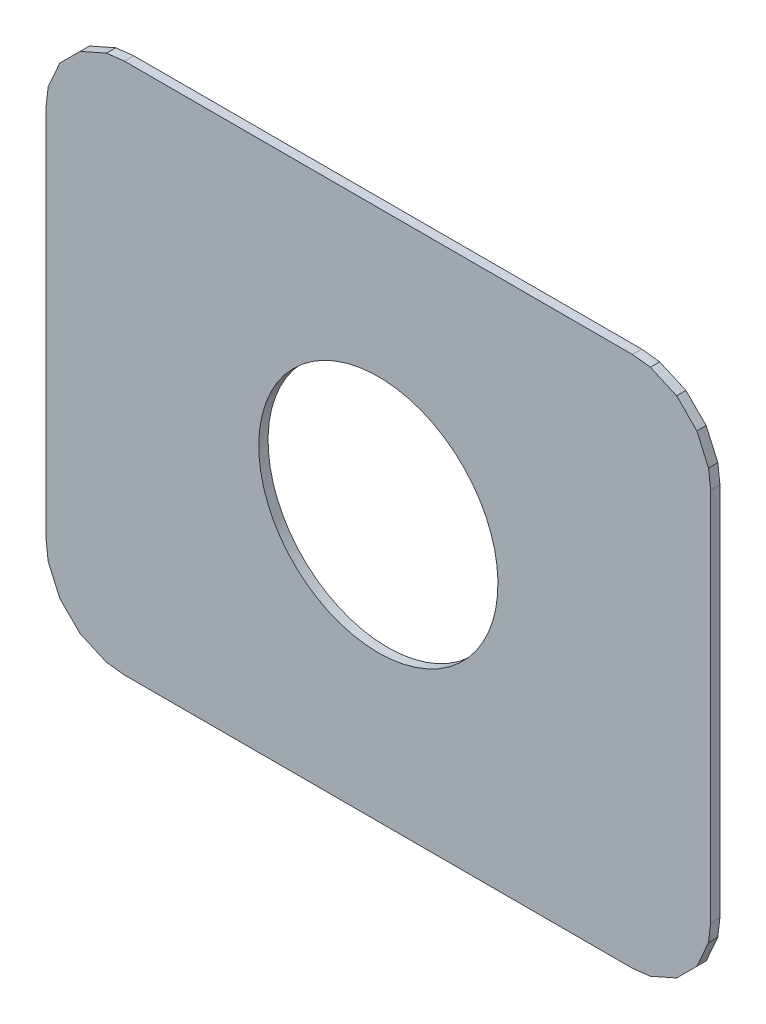
ISO-10303-21;
HEADER;
FILE_DESCRIPTION(('STEP AP214'),'2;1');
FILE_NAME('part.step','',(''),(''),'','','');
FILE_SCHEMA(('AUTOMOTIVE_DESIGN { 1 0 10303 214 1 1 1 1 }'));
ENDSEC;
DATA;
#1=APPLICATION_CONTEXT('core data for automotive mechanical design processes');
#2=APPLICATION_PROTOCOL_DEFINITION('international standard','automotive_design',2000,#1);
#3=PRODUCT_CONTEXT('',#1,'mechanical');
#4=PRODUCT('Part','Part','',(#3));
#5=PRODUCT_RELATED_PRODUCT_CATEGORY('part','',(#4));
#6=PRODUCT_DEFINITION_FORMATION('','',#4);
#7=PRODUCT_DEFINITION_CONTEXT('part definition',#1,'design');
#8=PRODUCT_DEFINITION('design','',#6,#7);
#9=PRODUCT_DEFINITION_SHAPE('','',#8);
#10=(LENGTH_UNIT() NAMED_UNIT(*) SI_UNIT(.MILLI.,.METRE.));
#11=(NAMED_UNIT(*) PLANE_ANGLE_UNIT() SI_UNIT($,.RADIAN.));
#12=(NAMED_UNIT(*) SI_UNIT($,.STERADIAN.) SOLID_ANGLE_UNIT());
#13=UNCERTAINTY_MEASURE_WITH_UNIT(LENGTH_MEASURE(1.E-05),#10,'distance_accuracy_value','');
#14=(GEOMETRIC_REPRESENTATION_CONTEXT(3) GLOBAL_UNCERTAINTY_ASSIGNED_CONTEXT((#13)) GLOBAL_UNIT_ASSIGNED_CONTEXT((#10,
#11,#12)) REPRESENTATION_CONTEXT('',''));
#15=CARTESIAN_POINT('',(0.,0.,0.));
#16=DIRECTION('',(0.,0.,1.));
#17=DIRECTION('',(1.,0.,0.));
#18=AXIS2_PLACEMENT_3D('',#15,#16,#17);
#19=CARTESIAN_POINT('',(177.26,-119.456,-0.045));
#20=DIRECTION('',(0.,0.,-1.));
#21=DIRECTION('',(0.,-1.,0.));
#22=AXIS2_PLACEMENT_3D('',#19,#20,#21);
#23=CYLINDRICAL_SURFACE('',#22,0.45);
#24=CARTESIAN_POINT('',(177.26,-119.456,-0.035));
#25=DIRECTION('',(0.,0.,-1.));
#26=DIRECTION('',(0.,-1.,0.));
#27=AXIS2_PLACEMENT_3D('',#24,#25,#26);
#28=CIRCLE('',#27,0.45);
#29=CARTESIAN_POINT('',(177.26,-119.906,-0.035));
#30=VERTEX_POINT('',#29);
#31=EDGE_CURVE('E283',#30,#30,#28,.T.);
#32=ORIENTED_EDGE('',*,*,#31,.T.);
#33=DIRECTION('',(0.,0.,1.));
#34=VECTOR('',#33,1.);
#35=CARTESIAN_POINT('',(177.26,-119.906,-0.045));
#36=LINE('',#35,#34);
#37=CARTESIAN_POINT('',(177.26,-119.906,0.));
#38=VERTEX_POINT('',#37);
#39=EDGE_CURVE('E11',#30,#38,#36,.T.);
#40=ORIENTED_EDGE('',*,*,#39,.T.);
#41=CARTESIAN_POINT('',(177.26,-119.456,0.));
#42=DIRECTION('',(0.,0.,-1.));
#43=DIRECTION('',(0.,-1.,0.));
#44=AXIS2_PLACEMENT_3D('',#41,#42,#43);
#45=CIRCLE('',#44,0.45);
#46=EDGE_CURVE('E418',#38,#38,#45,.T.);
#47=ORIENTED_EDGE('',*,*,#46,.F.);
#48=ORIENTED_EDGE('',*,*,#39,.F.);
#49=EDGE_LOOP('',(#32,#40,#47,#48));
#50=FACE_BOUND('',#49,.T.);
#51=ADVANCED_FACE('F17',(#50),#23,.F.);
#52=CARTESIAN_POINT('',(176.23678,-120.448188,-0.035));
#53=DIRECTION('',(-0.403918300516903,-0.91479506257278,0.));
#54=DIRECTION('',(-0.91479506257278,0.403918300516903,0.));
#55=AXIS2_PLACEMENT_3D('',#52,#53,#54);
#56=PLANE('',#55);
#57=DIRECTION('',(0.,0.,1.));
#58=VECTOR('',#57,1.);
#59=CARTESIAN_POINT('',(176.23678,-120.448188,-0.035));
#60=LINE('',#59,#58);
#61=CARTESIAN_POINT('',(176.23678,-120.448188,-0.035));
#62=VERTEX_POINT('',#61);
#63=CARTESIAN_POINT('',(176.23678,-120.448188,0.));
#64=VERTEX_POINT('',#63);
#65=EDGE_CURVE('E25',#62,#64,#60,.T.);
#66=ORIENTED_EDGE('',*,*,#65,.T.);
#67=DIRECTION('',(-0.91479506257278,0.403918300516903,0.));
#68=VECTOR('',#67,1.);
#69=CARTESIAN_POINT('',(176.23678,-120.448188,0.));
#70=LINE('',#69,#68);
#71=CARTESIAN_POINT('',(176.137901,-120.404529,0.));
#72=VERTEX_POINT('',#71);
#73=EDGE_CURVE('E366',#64,#72,#70,.T.);
#74=ORIENTED_EDGE('',*,*,#73,.T.);
#75=DIRECTION('',(0.,0.,1.));
#76=VECTOR('',#75,1.);
#77=CARTESIAN_POINT('',(176.137901,-120.404529,-0.035));
#78=LINE('',#77,#76);
#79=CARTESIAN_POINT('',(176.137901,-120.404529,-0.035));
#80=VERTEX_POINT('',#79);
#81=EDGE_CURVE('E348',#80,#72,#78,.T.);
#82=ORIENTED_EDGE('',*,*,#81,.F.);
#83=DIRECTION('',(-0.91479506257278,0.403918300516903,0.));
#84=VECTOR('',#83,1.);
#85=CARTESIAN_POINT('',(176.23678,-120.448188,-0.035));
#86=LINE('',#85,#84);
#87=EDGE_CURVE('E295',#62,#80,#86,.T.);
#88=ORIENTED_EDGE('',*,*,#87,.F.);
#89=EDGE_LOOP('',(#66,#74,#82,#88));
#90=FACE_BOUND('',#89,.T.);
#91=ADVANCED_FACE('F456',(#90),#56,.T.);
#92=CARTESIAN_POINT('',(176.304118,-120.456,-0.035));
#93=DIRECTION('',(-0.115238869062998,-0.99333780913498,0.));
#94=DIRECTION('',(-0.99333780913498,0.115238869062998,0.));
#95=AXIS2_PLACEMENT_3D('',#92,#93,#94);
#96=PLANE('',#95);
#97=DIRECTION('',(0.,0.,1.));
#98=VECTOR('',#97,1.);
#99=CARTESIAN_POINT('',(176.304118,-120.456,-0.035));
#100=LINE('',#99,#98);
#101=CARTESIAN_POINT('',(176.304118,-120.456,-0.035));
#102=VERTEX_POINT('',#101);
#103=CARTESIAN_POINT('',(176.304118,-120.456,0.));
#104=VERTEX_POINT('',#103);
#105=EDGE_CURVE('E345',#102,#104,#100,.T.);
#106=ORIENTED_EDGE('',*,*,#105,.T.);
#107=DIRECTION('',(-0.99333780913498,0.115238869062998,0.));
#108=VECTOR('',#107,1.);
#109=CARTESIAN_POINT('',(176.304118,-120.456,0.));
#110=LINE('',#109,#108);
#111=EDGE_CURVE('E370',#104,#64,#110,.T.);
#112=ORIENTED_EDGE('',*,*,#111,.T.);
#113=ORIENTED_EDGE('',*,*,#65,.F.);
#114=DIRECTION('',(-0.99333780913498,0.115238869062998,0.));
#115=VECTOR('',#114,1.);
#116=CARTESIAN_POINT('',(176.304118,-120.456,-0.035));
#117=LINE('',#116,#115);
#118=EDGE_CURVE('E291',#102,#62,#117,.T.);
#119=ORIENTED_EDGE('',*,*,#118,.F.);
#120=EDGE_LOOP('',(#106,#112,#113,#119));
#121=FACE_BOUND('',#120,.T.);
#122=ADVANCED_FACE('F462',(#121),#96,.T.);
#123=CARTESIAN_POINT('',(176.137901,-120.404529,-0.035));
#124=DIRECTION('',(-0.707106781187048,-0.707106781186048,0.));
#125=DIRECTION('',(-0.707106781186048,0.707106781187048,0.));
#126=AXIS2_PLACEMENT_3D('',#123,#124,#125);
#127=PLANE('',#126);
#128=ORIENTED_EDGE('',*,*,#81,.T.);
#129=DIRECTION('',(-0.707106781186048,0.707106781187048,0.));
#130=VECTOR('',#129,1.);
#131=CARTESIAN_POINT('',(176.137901,-120.404529,0.));
#132=LINE('',#131,#130);
#133=CARTESIAN_POINT('',(176.061471,-120.328099,0.));
#134=VERTEX_POINT('',#133);
#135=EDGE_CURVE('E371',#72,#134,#132,.T.);
#136=ORIENTED_EDGE('',*,*,#135,.T.);
#137=DIRECTION('',(0.,0.,1.));
#138=VECTOR('',#137,1.);
#139=CARTESIAN_POINT('',(176.061471,-120.328099,-0.035));
#140=LINE('',#139,#138);
#141=CARTESIAN_POINT('',(176.061471,-120.328099,-0.035));
#142=VERTEX_POINT('',#141);
#143=EDGE_CURVE('E349',#142,#134,#140,.T.);
#144=ORIENTED_EDGE('',*,*,#143,.F.);
#145=DIRECTION('',(-0.707106781186048,0.707106781187048,0.));
#146=VECTOR('',#145,1.);
#147=CARTESIAN_POINT('',(176.137901,-120.404529,-0.035));
#148=LINE('',#147,#146);
#149=EDGE_CURVE('E299',#80,#142,#148,.T.);
#150=ORIENTED_EDGE('',*,*,#149,.F.);
#151=EDGE_LOOP('',(#128,#136,#144,#150));
#152=FACE_BOUND('',#151,.T.);
#153=ADVANCED_FACE('F471',(#152),#127,.T.);
#154=CARTESIAN_POINT('',(178.215882,-120.456,-0.035));
#155=DIRECTION('',(0.,-1.,0.));
#156=DIRECTION('',(0.,0.,-1.));
#157=AXIS2_PLACEMENT_3D('',#154,#155,#156);
#158=PLANE('',#157);
#159=DIRECTION('',(0.,0.,1.));
#160=VECTOR('',#159,1.);
#161=CARTESIAN_POINT('',(178.215882,-120.456,-0.035));
#162=LINE('',#161,#160);
#163=CARTESIAN_POINT('',(178.215882,-120.456,-0.035));
#164=VERTEX_POINT('',#163);
#165=CARTESIAN_POINT('',(178.215882,-120.456,0.));
#166=VERTEX_POINT('',#165);
#167=EDGE_CURVE('E258',#164,#166,#162,.T.);
#168=ORIENTED_EDGE('',*,*,#167,.T.);
#169=DIRECTION('',(-1.,0.,0.));
#170=VECTOR('',#169,1.);
#171=CARTESIAN_POINT('',(178.215882,-120.456,0.));
#172=LINE('',#171,#170);
#173=EDGE_CURVE('E380',#166,#104,#172,.T.);
#174=ORIENTED_EDGE('',*,*,#173,.T.);
#175=ORIENTED_EDGE('',*,*,#105,.F.);
#176=DIRECTION('',(-1.,0.,0.));
#177=VECTOR('',#176,1.);
#178=CARTESIAN_POINT('',(178.215882,-120.456,-0.035));
#179=LINE('',#178,#177);
#180=EDGE_CURVE('E263',#164,#102,#179,.T.);
#181=ORIENTED_EDGE('',*,*,#180,.F.);
#182=EDGE_LOOP('',(#168,#174,#175,#181));
#183=FACE_BOUND('',#182,.T.);
#184=ADVANCED_FACE('F475',(#183),#158,.T.);
#185=CARTESIAN_POINT('',(176.061471,-120.328099,-0.035));
#186=DIRECTION('',(-0.914795062572411,-0.40391830051774,0.));
#187=DIRECTION('',(-0.40391830051774,0.914795062572411,0.));
#188=AXIS2_PLACEMENT_3D('',#185,#186,#187);
#189=PLANE('',#188);
#190=ORIENTED_EDGE('',*,*,#143,.T.);
#191=DIRECTION('',(-0.40391830051774,0.914795062572411,0.));
#192=VECTOR('',#191,1.);
#193=CARTESIAN_POINT('',(176.061471,-120.328099,0.));
#194=LINE('',#193,#192);
#195=CARTESIAN_POINT('',(176.017812,-120.22922,0.));
#196=VERTEX_POINT('',#195);
#197=EDGE_CURVE('E376',#134,#196,#194,.T.);
#198=ORIENTED_EDGE('',*,*,#197,.T.);
#199=DIRECTION('',(0.,0.,1.));
#200=VECTOR('',#199,1.);
#201=CARTESIAN_POINT('',(176.017812,-120.22922,-0.035));
#202=LINE('',#201,#200);
#203=CARTESIAN_POINT('',(176.017812,-120.22922,-0.035));
#204=VERTEX_POINT('',#203);
#205=EDGE_CURVE('E252',#204,#196,#202,.T.);
#206=ORIENTED_EDGE('',*,*,#205,.F.);
#207=DIRECTION('',(-0.40391830051774,0.914795062572411,0.));
#208=VECTOR('',#207,1.);
#209=CARTESIAN_POINT('',(176.061471,-120.328099,-0.035));
#210=LINE('',#209,#208);
#211=EDGE_CURVE('E303',#142,#204,#210,.T.);
#212=ORIENTED_EDGE('',*,*,#211,.F.);
#213=EDGE_LOOP('',(#190,#198,#206,#212));
#214=FACE_BOUND('',#213,.T.);
#215=ADVANCED_FACE('F619',(#214),#189,.T.);
#216=CARTESIAN_POINT('',(178.28322,-120.448188,-0.035));
#217=DIRECTION('',(0.115238869062998,-0.99333780913498,0.));
#218=DIRECTION('',(0.,0.,-1.));
#219=AXIS2_PLACEMENT_3D('',#216,#217,#218);
#220=PLANE('',#219);
#221=DIRECTION('',(0.,0.,1.));
#222=VECTOR('',#221,1.);
#223=CARTESIAN_POINT('',(178.28322,-120.448188,-0.035));
#224=LINE('',#223,#222);
#225=CARTESIAN_POINT('',(178.28322,-120.448188,-0.035));
#226=VERTEX_POINT('',#225);
#227=CARTESIAN_POINT('',(178.28322,-120.448188,0.));
#228=VERTEX_POINT('',#227);
#229=EDGE_CURVE('E240',#226,#228,#224,.T.);
#230=ORIENTED_EDGE('',*,*,#229,.T.);
#231=DIRECTION('',(-0.99333780913498,-0.115238869062998,0.));
#232=VECTOR('',#231,1.);
#233=CARTESIAN_POINT('',(178.28322,-120.448188,0.));
#234=LINE('',#233,#232);
#235=EDGE_CURVE('E384',#228,#166,#234,.T.);
#236=ORIENTED_EDGE('',*,*,#235,.T.);
#237=ORIENTED_EDGE('',*,*,#167,.F.);
#238=DIRECTION('',(-0.99333780913498,-0.115238869062998,0.));
#239=VECTOR('',#238,1.);
#240=CARTESIAN_POINT('',(178.28322,-120.448188,-0.035));
#241=LINE('',#240,#239);
#242=EDGE_CURVE('E256',#226,#164,#241,.T.);
#243=ORIENTED_EDGE('',*,*,#242,.F.);
#244=EDGE_LOOP('',(#230,#236,#237,#243));
#245=FACE_BOUND('',#244,.T.);
#246=ADVANCED_FACE('F257',(#245),#220,.T.);
#247=CARTESIAN_POINT('',(176.017812,-120.22922,-0.035));
#248=DIRECTION('',(-0.99333780913498,-0.115238869062998,0.));
#249=DIRECTION('',(-0.115238869062998,0.99333780913498,0.));
#250=AXIS2_PLACEMENT_3D('',#247,#248,#249);
#251=PLANE('',#250);
#252=ORIENTED_EDGE('',*,*,#205,.T.);
#253=DIRECTION('',(-0.115238869062998,0.99333780913498,0.));
#254=VECTOR('',#253,1.);
#255=CARTESIAN_POINT('',(176.017812,-120.22922,0.));
#256=LINE('',#255,#254);
#257=CARTESIAN_POINT('',(176.01,-120.161882,0.));
#258=VERTEX_POINT('',#257);
#259=EDGE_CURVE('E372',#196,#258,#256,.T.);
#260=ORIENTED_EDGE('',*,*,#259,.T.);
#261=DIRECTION('',(0.,0.,1.));
#262=VECTOR('',#261,1.);
#263=CARTESIAN_POINT('',(176.01,-120.161882,-0.035));
#264=LINE('',#263,#262);
#265=CARTESIAN_POINT('',(176.01,-120.161882,-0.035));
#266=VERTEX_POINT('',#265);
#267=EDGE_CURVE('E253',#266,#258,#264,.T.);
#268=ORIENTED_EDGE('',*,*,#267,.F.);
#269=DIRECTION('',(-0.115238869062998,0.99333780913498,0.));
#270=VECTOR('',#269,1.);
#271=CARTESIAN_POINT('',(176.017812,-120.22922,-0.035));
#272=LINE('',#271,#270);
#273=EDGE_CURVE('E307',#204,#266,#272,.T.);
#274=ORIENTED_EDGE('',*,*,#273,.F.);
#275=EDGE_LOOP('',(#252,#260,#268,#274));
#276=FACE_BOUND('',#275,.T.);
#277=ADVANCED_FACE('F625',(#276),#251,.T.);
#278=CARTESIAN_POINT('',(178.382099,-120.404529,-0.035));
#279=DIRECTION('',(0.403918300516903,-0.91479506257278,0.));
#280=DIRECTION('',(0.,0.,-1.));
#281=AXIS2_PLACEMENT_3D('',#278,#279,#280);
#282=PLANE('',#281);
#283=DIRECTION('',(0.,0.,1.));
#284=VECTOR('',#283,1.);
#285=CARTESIAN_POINT('',(178.382099,-120.404529,-0.035));
#286=LINE('',#285,#284);
#287=CARTESIAN_POINT('',(178.382099,-120.404529,-0.035));
#288=VERTEX_POINT('',#287);
#289=CARTESIAN_POINT('',(178.382099,-120.404529,0.));
#290=VERTEX_POINT('',#289);
#291=EDGE_CURVE('E393',#288,#290,#286,.T.);
#292=ORIENTED_EDGE('',*,*,#291,.T.);
#293=DIRECTION('',(-0.91479506257278,-0.403918300516903,0.));
#294=VECTOR('',#293,1.);
#295=CARTESIAN_POINT('',(178.382099,-120.404529,0.));
#296=LINE('',#295,#294);
#297=EDGE_CURVE('E247',#290,#228,#296,.T.);
#298=ORIENTED_EDGE('',*,*,#297,.T.);
#299=ORIENTED_EDGE('',*,*,#229,.F.);
#300=DIRECTION('',(-0.91479506257278,-0.403918300516903,0.));
#301=VECTOR('',#300,1.);
#302=CARTESIAN_POINT('',(178.382099,-120.404529,-0.035));
#303=LINE('',#302,#301);
#304=EDGE_CURVE('E244',#288,#226,#303,.T.);
#305=ORIENTED_EDGE('',*,*,#304,.F.);
#306=EDGE_LOOP('',(#292,#298,#299,#305));
#307=FACE_BOUND('',#306,.T.);
#308=ADVANCED_FACE('F242',(#307),#282,.T.);
#309=CARTESIAN_POINT('',(176.01,-120.161882,-0.035));
#310=DIRECTION('',(-1.,0.,0.));
#311=DIRECTION('',(0.,0.,1.));
#312=AXIS2_PLACEMENT_3D('',#309,#310,#311);
#313=PLANE('',#312);
#314=ORIENTED_EDGE('',*,*,#267,.T.);
#315=DIRECTION('',(0.,1.,0.));
#316=VECTOR('',#315,1.);
#317=CARTESIAN_POINT('',(176.01,-120.161882,0.));
#318=LINE('',#317,#316);
#319=CARTESIAN_POINT('',(176.01,-118.750118,0.));
#320=VERTEX_POINT('',#319);
#321=EDGE_CURVE('E365',#258,#320,#318,.T.);
#322=ORIENTED_EDGE('',*,*,#321,.T.);
#323=DIRECTION('',(0.,0.,1.));
#324=VECTOR('',#323,1.);
#325=CARTESIAN_POINT('',(176.01,-118.750118,-0.035));
#326=LINE('',#325,#324);
#327=CARTESIAN_POINT('',(176.01,-118.750118,-0.035));
#328=VERTEX_POINT('',#327);
#329=EDGE_CURVE('E396',#328,#320,#326,.T.);
#330=ORIENTED_EDGE('',*,*,#329,.F.);
#331=DIRECTION('',(0.,1.,0.));
#332=VECTOR('',#331,1.);
#333=CARTESIAN_POINT('',(176.01,-120.161882,-0.035));
#334=LINE('',#333,#332);
#335=EDGE_CURVE('E308',#266,#328,#334,.T.);
#336=ORIENTED_EDGE('',*,*,#335,.F.);
#337=EDGE_LOOP('',(#314,#322,#330,#336));
#338=FACE_BOUND('',#337,.T.);
#339=ADVANCED_FACE('F858',(#338),#313,.T.);
#340=CARTESIAN_POINT('',(178.458529,-120.328099,-0.035));
#341=DIRECTION('',(0.707106781187048,-0.707106781186048,0.));
#342=DIRECTION('',(0.,0.,-1.));
#343=AXIS2_PLACEMENT_3D('',#340,#341,#342);
#344=PLANE('',#343);
#345=DIRECTION('',(0.,0.,1.));
#346=VECTOR('',#345,1.);
#347=CARTESIAN_POINT('',(178.458529,-120.328099,-0.035));
#348=LINE('',#347,#346);
#349=CARTESIAN_POINT('',(178.458529,-120.328099,-0.035));
#350=VERTEX_POINT('',#349);
#351=CARTESIAN_POINT('',(178.458529,-120.328099,0.));
#352=VERTEX_POINT('',#351);
#353=EDGE_CURVE('E437',#350,#352,#348,.T.);
#354=ORIENTED_EDGE('',*,*,#353,.T.);
#355=DIRECTION('',(-0.707106781186048,-0.707106781187048,0.));
#356=VECTOR('',#355,1.);
#357=CARTESIAN_POINT('',(178.458529,-120.328099,0.));
#358=LINE('',#357,#356);
#359=EDGE_CURVE('E392',#352,#290,#358,.T.);
#360=ORIENTED_EDGE('',*,*,#359,.T.);
#361=ORIENTED_EDGE('',*,*,#291,.F.);
#362=DIRECTION('',(-0.707106781186048,-0.707106781187048,0.));
#363=VECTOR('',#362,1.);
#364=CARTESIAN_POINT('',(178.458529,-120.328099,-0.035));
#365=LINE('',#364,#363);
#366=EDGE_CURVE('E269',#350,#288,#365,.T.);
#367=ORIENTED_EDGE('',*,*,#366,.F.);
#368=EDGE_LOOP('',(#354,#360,#361,#367));
#369=FACE_BOUND('',#368,.T.);
#370=ADVANCED_FACE('F480',(#369),#344,.T.);
#371=CARTESIAN_POINT('',(176.01,-118.750118,-0.035));
#372=DIRECTION('',(-0.99333780913498,0.115238869062998,0.));
#373=DIRECTION('',(0.,0.,1.));
#374=AXIS2_PLACEMENT_3D('',#371,#372,#373);
#375=PLANE('',#374);
#376=ORIENTED_EDGE('',*,*,#329,.T.);
#377=DIRECTION('',(0.115238869062998,0.99333780913498,0.));
#378=VECTOR('',#377,1.);
#379=CARTESIAN_POINT('',(176.01,-118.750118,0.));
#380=LINE('',#379,#378);
#381=CARTESIAN_POINT('',(176.017812,-118.68278,0.));
#382=VERTEX_POINT('',#381);
#383=EDGE_CURVE('E361',#320,#382,#380,.T.);
#384=ORIENTED_EDGE('',*,*,#383,.T.);
#385=DIRECTION('',(0.,0.,1.));
#386=VECTOR('',#385,1.);
#387=CARTESIAN_POINT('',(176.017812,-118.68278,-0.035));
#388=LINE('',#387,#386);
#389=CARTESIAN_POINT('',(176.017812,-118.68278,-0.035));
#390=VERTEX_POINT('',#389);
#391=EDGE_CURVE('E436',#390,#382,#388,.T.);
#392=ORIENTED_EDGE('',*,*,#391,.F.);
#393=DIRECTION('',(0.115238869062998,0.99333780913498,0.));
#394=VECTOR('',#393,1.);
#395=CARTESIAN_POINT('',(176.01,-118.750118,-0.035));
#396=LINE('',#395,#394);
#397=EDGE_CURVE('E312',#328,#390,#396,.T.);
#398=ORIENTED_EDGE('',*,*,#397,.F.);
#399=EDGE_LOOP('',(#376,#384,#392,#398));
#400=FACE_BOUND('',#399,.T.);
#401=ADVANCED_FACE('F852',(#400),#375,.T.);
#402=CARTESIAN_POINT('',(178.502188,-120.22922,-0.035));
#403=DIRECTION('',(0.91479506257278,-0.403918300516903,0.));
#404=DIRECTION('',(0.,0.,-1.));
#405=AXIS2_PLACEMENT_3D('',#402,#403,#404);
#406=PLANE('',#405);
#407=DIRECTION('',(0.,0.,1.));
#408=VECTOR('',#407,1.);
#409=CARTESIAN_POINT('',(178.502188,-120.22922,-0.035));
#410=LINE('',#409,#408);
#411=CARTESIAN_POINT('',(178.502188,-120.22922,-0.035));
#412=VERTEX_POINT('',#411);
#413=CARTESIAN_POINT('',(178.502188,-120.22922,0.));
#414=VERTEX_POINT('',#413);
#415=EDGE_CURVE('E433',#412,#414,#410,.T.);
#416=ORIENTED_EDGE('',*,*,#415,.T.);
#417=DIRECTION('',(-0.403918300516903,-0.91479506257278,0.));
#418=VECTOR('',#417,1.);
#419=CARTESIAN_POINT('',(178.502188,-120.22922,0.));
#420=LINE('',#419,#418);
#421=EDGE_CURVE('E400',#414,#352,#420,.T.);
#422=ORIENTED_EDGE('',*,*,#421,.T.);
#423=ORIENTED_EDGE('',*,*,#353,.F.);
#424=DIRECTION('',(-0.403918300516903,-0.91479506257278,0.));
#425=VECTOR('',#424,1.);
#426=CARTESIAN_POINT('',(178.502188,-120.22922,-0.035));
#427=LINE('',#426,#425);
#428=EDGE_CURVE('E276',#412,#350,#427,.T.);
#429=ORIENTED_EDGE('',*,*,#428,.F.);
#430=EDGE_LOOP('',(#416,#422,#423,#429));
#431=FACE_BOUND('',#430,.T.);
#432=ADVANCED_FACE('F483',(#431),#406,.T.);
#433=CARTESIAN_POINT('',(176.017812,-118.68278,-0.035));
#434=DIRECTION('',(-0.914795062572411,0.40391830051774,0.));
#435=DIRECTION('',(0.,0.,1.));
#436=AXIS2_PLACEMENT_3D('',#433,#434,#435);
#437=PLANE('',#436);
#438=ORIENTED_EDGE('',*,*,#391,.T.);
#439=DIRECTION('',(0.40391830051774,0.914795062572411,0.));
#440=VECTOR('',#439,1.);
#441=CARTESIAN_POINT('',(176.017812,-118.68278,0.));
#442=LINE('',#441,#440);
#443=CARTESIAN_POINT('',(176.061471,-118.583901,0.));
#444=VERTEX_POINT('',#443);
#445=EDGE_CURVE('E357',#382,#444,#442,.T.);
#446=ORIENTED_EDGE('',*,*,#445,.T.);
#447=DIRECTION('',(0.,0.,1.));
#448=VECTOR('',#447,1.);
#449=CARTESIAN_POINT('',(176.061471,-118.583901,-0.035));
#450=LINE('',#449,#448);
#451=CARTESIAN_POINT('',(176.061471,-118.583901,-0.035));
#452=VERTEX_POINT('',#451);
#453=EDGE_CURVE('E430',#452,#444,#450,.T.);
#454=ORIENTED_EDGE('',*,*,#453,.F.);
#455=DIRECTION('',(0.40391830051774,0.914795062572411,0.));
#456=VECTOR('',#455,1.);
#457=CARTESIAN_POINT('',(176.017812,-118.68278,-0.035));
#458=LINE('',#457,#456);
#459=EDGE_CURVE('E316',#390,#452,#458,.T.);
#460=ORIENTED_EDGE('',*,*,#459,.F.);
#461=EDGE_LOOP('',(#438,#446,#454,#460));
#462=FACE_BOUND('',#461,.T.);
#463=ADVANCED_FACE('F847',(#462),#437,.T.);
#464=CARTESIAN_POINT('',(178.51,-120.161882,-0.035));
#465=DIRECTION('',(0.99333780913498,-0.115238869062998,0.));
#466=DIRECTION('',(0.,0.,-1.));
#467=AXIS2_PLACEMENT_3D('',#464,#465,#466);
#468=PLANE('',#467);
#469=DIRECTION('',(0.,0.,1.));
#470=VECTOR('',#469,1.);
#471=CARTESIAN_POINT('',(178.51,-120.161882,-0.035));
#472=LINE('',#471,#470);
#473=CARTESIAN_POINT('',(178.51,-120.161882,-0.035));
#474=VERTEX_POINT('',#473);
#475=CARTESIAN_POINT('',(178.51,-120.161882,0.));
#476=VERTEX_POINT('',#475);
#477=EDGE_CURVE('E328',#474,#476,#472,.T.);
#478=ORIENTED_EDGE('',*,*,#477,.T.);
#479=DIRECTION('',(-0.115238869062998,-0.99333780913498,0.));
#480=VECTOR('',#479,1.);
#481=CARTESIAN_POINT('',(178.51,-120.161882,0.));
#482=LINE('',#481,#480);
#483=EDGE_CURVE('E404',#476,#414,#482,.T.);
#484=ORIENTED_EDGE('',*,*,#483,.T.);
#485=ORIENTED_EDGE('',*,*,#415,.F.);
#486=DIRECTION('',(-0.115238869062998,-0.99333780913498,0.));
#487=VECTOR('',#486,1.);
#488=CARTESIAN_POINT('',(178.51,-120.161882,-0.035));
#489=LINE('',#488,#487);
#490=EDGE_CURVE('E575',#474,#412,#489,.T.);
#491=ORIENTED_EDGE('',*,*,#490,.F.);
#492=EDGE_LOOP('',(#478,#484,#485,#491));
#493=FACE_BOUND('',#492,.T.);
#494=ADVANCED_FACE('F487',(#493),#468,.T.);
#495=CARTESIAN_POINT('',(176.061471,-118.583901,-0.035));
#496=DIRECTION('',(-0.707106781187048,0.707106781186048,0.));
#497=DIRECTION('',(0.,0.,1.));
#498=AXIS2_PLACEMENT_3D('',#495,#496,#497);
#499=PLANE('',#498);
#500=ORIENTED_EDGE('',*,*,#453,.T.);
#501=DIRECTION('',(0.707106781186048,0.707106781187048,0.));
#502=VECTOR('',#501,1.);
#503=CARTESIAN_POINT('',(176.061471,-118.583901,0.));
#504=LINE('',#503,#502);
#505=CARTESIAN_POINT('',(176.137901,-118.507471,0.));
#506=VERTEX_POINT('',#505);
#507=EDGE_CURVE('E353',#444,#506,#504,.T.);
#508=ORIENTED_EDGE('',*,*,#507,.T.);
#509=DIRECTION('',(0.,0.,1.));
#510=VECTOR('',#509,1.);
#511=CARTESIAN_POINT('',(176.137901,-118.507471,-0.035));
#512=LINE('',#511,#510);
#513=CARTESIAN_POINT('',(176.137901,-118.507471,-0.035));
#514=VERTEX_POINT('',#513);
#515=EDGE_CURVE('E325',#514,#506,#512,.T.);
#516=ORIENTED_EDGE('',*,*,#515,.F.);
#517=DIRECTION('',(0.707106781186048,0.707106781187048,0.));
#518=VECTOR('',#517,1.);
#519=CARTESIAN_POINT('',(176.061471,-118.583901,-0.035));
#520=LINE('',#519,#518);
#521=EDGE_CURVE('E324',#452,#514,#520,.T.);
#522=ORIENTED_EDGE('',*,*,#521,.F.);
#523=EDGE_LOOP('',(#500,#508,#516,#522));
#524=FACE_BOUND('',#523,.T.);
#525=ADVANCED_FACE('F854',(#524),#499,.T.);
#526=CARTESIAN_POINT('',(178.51,-118.750118,-0.035));
#527=DIRECTION('',(1.,0.,0.));
#528=DIRECTION('',(0.,1.,0.));
#529=AXIS2_PLACEMENT_3D('',#526,#527,#528);
#530=PLANE('',#529);
#531=DIRECTION('',(0.,0.,1.));
#532=VECTOR('',#531,1.);
#533=CARTESIAN_POINT('',(178.51,-118.750118,-0.035));
#534=LINE('',#533,#532);
#535=CARTESIAN_POINT('',(178.51,-118.750118,-0.035));
#536=VERTEX_POINT('',#535);
#537=CARTESIAN_POINT('',(178.51,-118.750118,0.));
#538=VERTEX_POINT('',#537);
#539=EDGE_CURVE('E320',#536,#538,#534,.T.);
#540=ORIENTED_EDGE('',*,*,#539,.T.);
#541=DIRECTION('',(0.,-1.,0.));
#542=VECTOR('',#541,1.);
#543=CARTESIAN_POINT('',(178.51,-118.750118,0.));
#544=LINE('',#543,#542);
#545=EDGE_CURVE('E408',#538,#476,#544,.T.);
#546=ORIENTED_EDGE('',*,*,#545,.T.);
#547=ORIENTED_EDGE('',*,*,#477,.F.);
#548=DIRECTION('',(0.,-1.,0.));
#549=VECTOR('',#548,1.);
#550=CARTESIAN_POINT('',(178.51,-118.750118,-0.035));
#551=LINE('',#550,#549);
#552=EDGE_CURVE('E494',#536,#474,#551,.T.);
#553=ORIENTED_EDGE('',*,*,#552,.F.);
#554=EDGE_LOOP('',(#540,#546,#547,#553));
#555=FACE_BOUND('',#554,.T.);
#556=ADVANCED_FACE('F491',(#555),#530,.T.);
#557=CARTESIAN_POINT('',(176.137901,-118.507471,-0.035));
#558=DIRECTION('',(-0.403918300516903,0.91479506257278,0.));
#559=DIRECTION('',(0.,0.,1.));
#560=AXIS2_PLACEMENT_3D('',#557,#558,#559);
#561=PLANE('',#560);
#562=ORIENTED_EDGE('',*,*,#515,.T.);
#563=DIRECTION('',(0.91479506257278,0.403918300516903,0.));
#564=VECTOR('',#563,1.);
#565=CARTESIAN_POINT('',(176.137901,-118.507471,0.));
#566=LINE('',#565,#564);
#567=CARTESIAN_POINT('',(176.23678,-118.463812,0.));
#568=VERTEX_POINT('',#567);
#569=EDGE_CURVE('E344',#506,#568,#566,.T.);
#570=ORIENTED_EDGE('',*,*,#569,.T.);
#571=DIRECTION('',(0.,0.,1.));
#572=VECTOR('',#571,1.);
#573=CARTESIAN_POINT('',(176.23678,-118.463812,-0.035));
#574=LINE('',#573,#572);
#575=CARTESIAN_POINT('',(176.23678,-118.463812,-0.035));
#576=VERTEX_POINT('',#575);
#577=EDGE_CURVE('E317',#576,#568,#574,.T.);
#578=ORIENTED_EDGE('',*,*,#577,.F.);
#579=DIRECTION('',(0.91479506257278,0.403918300516903,0.));
#580=VECTOR('',#579,1.);
#581=CARTESIAN_POINT('',(176.137901,-118.507471,-0.035));
#582=LINE('',#581,#580);
#583=EDGE_CURVE('E332',#514,#576,#582,.T.);
#584=ORIENTED_EDGE('',*,*,#583,.F.);
#585=EDGE_LOOP('',(#562,#570,#578,#584));
#586=FACE_BOUND('',#585,.T.);
#587=ADVANCED_FACE('F499',(#586),#561,.T.);
#588=CARTESIAN_POINT('',(178.502188,-118.68278,-0.035));
#589=DIRECTION('',(0.99333780913498,0.115238869062998,0.));
#590=DIRECTION('',(0.,0.,-1.));
#591=AXIS2_PLACEMENT_3D('',#588,#589,#590);
#592=PLANE('',#591);
#593=DIRECTION('',(0.,0.,1.));
#594=VECTOR('',#593,1.);
#595=CARTESIAN_POINT('',(178.502188,-118.68278,-0.035));
#596=LINE('',#595,#594);
#597=CARTESIAN_POINT('',(178.502188,-118.68278,-0.035));
#598=VERTEX_POINT('',#597);
#599=CARTESIAN_POINT('',(178.502188,-118.68278,0.));
#600=VERTEX_POINT('',#599);
#601=EDGE_CURVE('E45',#598,#600,#596,.T.);
#602=ORIENTED_EDGE('',*,*,#601,.T.);
#603=DIRECTION('',(0.115238869062998,-0.99333780913498,0.));
#604=VECTOR('',#603,1.);
#605=CARTESIAN_POINT('',(178.502188,-118.68278,0.));
#606=LINE('',#605,#604);
#607=EDGE_CURVE('E412',#600,#538,#606,.T.);
#608=ORIENTED_EDGE('',*,*,#607,.T.);
#609=ORIENTED_EDGE('',*,*,#539,.F.);
#610=DIRECTION('',(0.115238869062998,-0.99333780913498,0.));
#611=VECTOR('',#610,1.);
#612=CARTESIAN_POINT('',(178.502188,-118.68278,-0.035));
#613=LINE('',#612,#611);
#614=EDGE_CURVE('E576',#598,#536,#613,.T.);
#615=ORIENTED_EDGE('',*,*,#614,.F.);
#616=EDGE_LOOP('',(#602,#608,#609,#615));
#617=FACE_BOUND('',#616,.T.);
#618=ADVANCED_FACE('F496',(#617),#592,.T.);
#619=CARTESIAN_POINT('',(176.23678,-118.463812,-0.035));
#620=DIRECTION('',(-0.115238869062998,0.99333780913498,0.));
#621=DIRECTION('',(0.,0.,1.));
#622=AXIS2_PLACEMENT_3D('',#619,#620,#621);
#623=PLANE('',#622);
#624=ORIENTED_EDGE('',*,*,#577,.T.);
#625=DIRECTION('',(0.99333780913498,0.115238869062998,0.));
#626=VECTOR('',#625,1.);
#627=CARTESIAN_POINT('',(176.23678,-118.463812,0.));
#628=LINE('',#627,#626);
#629=CARTESIAN_POINT('',(176.304118,-118.456,0.));
#630=VERTEX_POINT('',#629);
#631=EDGE_CURVE('E282',#568,#630,#628,.T.);
#632=ORIENTED_EDGE('',*,*,#631,.T.);
#633=DIRECTION('',(0.,0.,1.));
#634=VECTOR('',#633,1.);
#635=CARTESIAN_POINT('',(176.304118,-118.456,-0.035));
#636=LINE('',#635,#634);
#637=CARTESIAN_POINT('',(176.304118,-118.456,-0.035));
#638=VERTEX_POINT('',#637);
#639=EDGE_CURVE('E421',#638,#630,#636,.T.);
#640=ORIENTED_EDGE('',*,*,#639,.F.);
#641=DIRECTION('',(0.99333780913498,0.115238869062998,0.));
#642=VECTOR('',#641,1.);
#643=CARTESIAN_POINT('',(176.23678,-118.463812,-0.035));
#644=LINE('',#643,#642);
#645=EDGE_CURVE('E288',#576,#638,#644,.T.);
#646=ORIENTED_EDGE('',*,*,#645,.F.);
#647=EDGE_LOOP('',(#624,#632,#640,#646));
#648=FACE_BOUND('',#647,.T.);
#649=ADVANCED_FACE('F498',(#648),#623,.T.);
#650=CARTESIAN_POINT('',(178.458529,-118.583901,-0.035));
#651=DIRECTION('',(0.91479506257278,0.403918300516903,0.));
#652=DIRECTION('',(0.,0.,-1.));
#653=AXIS2_PLACEMENT_3D('',#650,#651,#652);
#654=PLANE('',#653);
#655=DIRECTION('',(0.,0.,1.));
#656=VECTOR('',#655,1.);
#657=CARTESIAN_POINT('',(178.458529,-118.583901,-0.035));
#658=LINE('',#657,#656);
#659=CARTESIAN_POINT('',(178.458529,-118.583901,-0.035));
#660=VERTEX_POINT('',#659);
#661=CARTESIAN_POINT('',(178.458529,-118.583901,0.));
#662=VERTEX_POINT('',#661);
#663=EDGE_CURVE('E583',#660,#662,#658,.T.);
#664=ORIENTED_EDGE('',*,*,#663,.T.);
#665=DIRECTION('',(0.403918300516903,-0.91479506257278,0.));
#666=VECTOR('',#665,1.);
#667=CARTESIAN_POINT('',(178.458529,-118.583901,0.));
#668=LINE('',#667,#666);
#669=EDGE_CURVE('E415',#662,#600,#668,.T.);
#670=ORIENTED_EDGE('',*,*,#669,.T.);
#671=ORIENTED_EDGE('',*,*,#601,.F.);
#672=DIRECTION('',(0.403918300516903,-0.91479506257278,0.));
#673=VECTOR('',#672,1.);
#674=CARTESIAN_POINT('',(178.458529,-118.583901,-0.035));
#675=LINE('',#674,#673);
#676=EDGE_CURVE('E590',#660,#598,#675,.T.);
#677=ORIENTED_EDGE('',*,*,#676,.F.);
#678=EDGE_LOOP('',(#664,#670,#671,#677));
#679=FACE_BOUND('',#678,.T.);
#680=ADVANCED_FACE('F507',(#679),#654,.T.);
#681=CARTESIAN_POINT('',(176.304118,-118.456,-0.035));
#682=DIRECTION('',(0.,1.,0.));
#683=DIRECTION('',(1.,0.,0.));
#684=AXIS2_PLACEMENT_3D('',#681,#682,#683);
#685=PLANE('',#684);
#686=ORIENTED_EDGE('',*,*,#639,.T.);
#687=DIRECTION('',(1.,0.,0.));
#688=VECTOR('',#687,1.);
#689=CARTESIAN_POINT('',(176.304118,-118.456,0.));
#690=LINE('',#689,#688);
#691=CARTESIAN_POINT('',(178.215882,-118.456,0.));
#692=VERTEX_POINT('',#691);
#693=EDGE_CURVE('E280',#630,#692,#690,.T.);
#694=ORIENTED_EDGE('',*,*,#693,.T.);
#695=DIRECTION('',(0.,0.,1.));
#696=VECTOR('',#695,1.);
#697=CARTESIAN_POINT('',(178.215882,-118.456,-0.035));
#698=LINE('',#697,#696);
#699=CARTESIAN_POINT('',(178.215882,-118.456,-0.035));
#700=VERTEX_POINT('',#699);
#701=EDGE_CURVE('E559',#700,#692,#698,.T.);
#702=ORIENTED_EDGE('',*,*,#701,.F.);
#703=DIRECTION('',(1.,0.,0.));
#704=VECTOR('',#703,1.);
#705=CARTESIAN_POINT('',(176.304118,-118.456,-0.035));
#706=LINE('',#705,#704);
#707=EDGE_CURVE('E285',#638,#700,#706,.T.);
#708=ORIENTED_EDGE('',*,*,#707,.F.);
#709=EDGE_LOOP('',(#686,#694,#702,#708));
#710=FACE_BOUND('',#709,.T.);
#711=ADVANCED_FACE('F531',(#710),#685,.T.);
#712=CARTESIAN_POINT('',(0.,0.,0.));
#713=DIRECTION('',(0.,0.,1.));
#714=DIRECTION('',(1.,0.,0.));
#715=AXIS2_PLACEMENT_3D('',#712,#713,#714);
#716=PLANE('',#715);
#717=ORIENTED_EDGE('',*,*,#46,.T.);
#718=EDGE_LOOP('',(#717));
#719=FACE_BOUND('',#718,.T.);
#720=DIRECTION('',(0.91479506257278,-0.403918300516903,0.));
#721=VECTOR('',#720,1.);
#722=CARTESIAN_POINT('',(178.28322,-118.463812,0.));
#723=LINE('',#722,#721);
#724=CARTESIAN_POINT('',(178.28322,-118.463812,0.));
#725=VERTEX_POINT('',#724);
#726=CARTESIAN_POINT('',(178.382099,-118.507471,0.));
#727=VERTEX_POINT('',#726);
#728=EDGE_CURVE('E553',#725,#727,#723,.T.);
#729=ORIENTED_EDGE('',*,*,#728,.F.);
#730=DIRECTION('',(0.99333780913498,-0.115238869062998,0.));
#731=VECTOR('',#730,1.);
#732=CARTESIAN_POINT('',(178.215882,-118.456,0.));
#733=LINE('',#732,#731);
#734=EDGE_CURVE('E550',#692,#725,#733,.T.);
#735=ORIENTED_EDGE('',*,*,#734,.F.);
#736=ORIENTED_EDGE('',*,*,#693,.F.);
#737=ORIENTED_EDGE('',*,*,#631,.F.);
#738=ORIENTED_EDGE('',*,*,#569,.F.);
#739=ORIENTED_EDGE('',*,*,#507,.F.);
#740=ORIENTED_EDGE('',*,*,#445,.F.);
#741=ORIENTED_EDGE('',*,*,#383,.F.);
#742=ORIENTED_EDGE('',*,*,#321,.F.);
#743=ORIENTED_EDGE('',*,*,#259,.F.);
#744=ORIENTED_EDGE('',*,*,#197,.F.);
#745=ORIENTED_EDGE('',*,*,#135,.F.);
#746=ORIENTED_EDGE('',*,*,#73,.F.);
#747=ORIENTED_EDGE('',*,*,#111,.F.);
#748=ORIENTED_EDGE('',*,*,#173,.F.);
#749=ORIENTED_EDGE('',*,*,#235,.F.);
#750=ORIENTED_EDGE('',*,*,#297,.F.);
#751=ORIENTED_EDGE('',*,*,#359,.F.);
#752=ORIENTED_EDGE('',*,*,#421,.F.);
#753=ORIENTED_EDGE('',*,*,#483,.F.);
#754=ORIENTED_EDGE('',*,*,#545,.F.);
#755=ORIENTED_EDGE('',*,*,#607,.F.);
#756=ORIENTED_EDGE('',*,*,#669,.F.);
#757=DIRECTION('',(0.707106781186048,-0.707106781187048,0.));
#758=VECTOR('',#757,1.);
#759=CARTESIAN_POINT('',(178.382099,-118.507471,0.));
#760=LINE('',#759,#758);
#761=EDGE_CURVE('E579',#727,#662,#760,.T.);
#762=ORIENTED_EDGE('',*,*,#761,.F.);
#763=EDGE_LOOP('',(#729,#735,#736,#737,#738,#739,#740,#741,#742,#743,#744,#745,#746,#747,#748,
#749,#750,#751,#752,#753,#754,#755,#756,#762));
#764=FACE_BOUND('',#763,.T.);
#765=ADVANCED_FACE('F466',(#719,#764),#716,.T.);
#766=CARTESIAN_POINT('',(0.,0.,-0.035));
#767=DIRECTION('',(0.,0.,1.));
#768=DIRECTION('',(1.,0.,0.));
#769=AXIS2_PLACEMENT_3D('',#766,#767,#768);
#770=PLANE('',#769);
#771=ORIENTED_EDGE('',*,*,#31,.F.);
#772=EDGE_LOOP('',(#771));
#773=FACE_BOUND('',#772,.T.);
#774=DIRECTION('',(0.707106781186048,-0.707106781187048,0.));
#775=VECTOR('',#774,1.);
#776=CARTESIAN_POINT('',(178.382099,-118.507471,-0.035));
#777=LINE('',#776,#775);
#778=CARTESIAN_POINT('',(178.382099,-118.507471,-0.035));
#779=VERTEX_POINT('',#778);
#780=EDGE_CURVE('E587',#779,#660,#777,.T.);
#781=ORIENTED_EDGE('',*,*,#780,.T.);
#782=ORIENTED_EDGE('',*,*,#676,.T.);
#783=ORIENTED_EDGE('',*,*,#614,.T.);
#784=ORIENTED_EDGE('',*,*,#552,.T.);
#785=ORIENTED_EDGE('',*,*,#490,.T.);
#786=ORIENTED_EDGE('',*,*,#428,.T.);
#787=ORIENTED_EDGE('',*,*,#366,.T.);
#788=ORIENTED_EDGE('',*,*,#304,.T.);
#789=ORIENTED_EDGE('',*,*,#242,.T.);
#790=ORIENTED_EDGE('',*,*,#180,.T.);
#791=ORIENTED_EDGE('',*,*,#118,.T.);
#792=ORIENTED_EDGE('',*,*,#87,.T.);
#793=ORIENTED_EDGE('',*,*,#149,.T.);
#794=ORIENTED_EDGE('',*,*,#211,.T.);
#795=ORIENTED_EDGE('',*,*,#273,.T.);
#796=ORIENTED_EDGE('',*,*,#335,.T.);
#797=ORIENTED_EDGE('',*,*,#397,.T.);
#798=ORIENTED_EDGE('',*,*,#459,.T.);
#799=ORIENTED_EDGE('',*,*,#521,.T.);
#800=ORIENTED_EDGE('',*,*,#583,.T.);
#801=ORIENTED_EDGE('',*,*,#645,.T.);
#802=ORIENTED_EDGE('',*,*,#707,.T.);
#803=DIRECTION('',(0.99333780913498,-0.115238869062998,0.));
#804=VECTOR('',#803,1.);
#805=CARTESIAN_POINT('',(178.215882,-118.456,-0.035));
#806=LINE('',#805,#804);
#807=CARTESIAN_POINT('',(178.28322,-118.463812,-0.035));
#808=VERTEX_POINT('',#807);
#809=EDGE_CURVE('E558',#700,#808,#806,.T.);
#810=ORIENTED_EDGE('',*,*,#809,.T.);
#811=DIRECTION('',(0.91479506257278,-0.403918300516903,0.));
#812=VECTOR('',#811,1.);
#813=CARTESIAN_POINT('',(178.28322,-118.463812,-0.035));
#814=LINE('',#813,#812);
#815=EDGE_CURVE('E563',#808,#779,#814,.T.);
#816=ORIENTED_EDGE('',*,*,#815,.T.);
#817=EDGE_LOOP('',(#781,#782,#783,#784,#785,#786,#787,#788,#789,#790,#791,#792,#793,#794,#795,
#796,#797,#798,#799,#800,#801,#802,#810,#816));
#818=FACE_BOUND('',#817,.T.);
#819=ADVANCED_FACE('F266',(#773,#818),#770,.F.);
#820=CARTESIAN_POINT('',(178.382099,-118.507471,-0.035));
#821=DIRECTION('',(0.707106781187048,0.707106781186048,0.));
#822=DIRECTION('',(0.,0.,-1.));
#823=AXIS2_PLACEMENT_3D('',#820,#821,#822);
#824=PLANE('',#823);
#825=DIRECTION('',(0.,0.,1.));
#826=VECTOR('',#825,1.);
#827=CARTESIAN_POINT('',(178.382099,-118.507471,-0.035));
#828=LINE('',#827,#826);
#829=EDGE_CURVE('E569',#779,#727,#828,.T.);
#830=ORIENTED_EDGE('',*,*,#829,.T.);
#831=ORIENTED_EDGE('',*,*,#761,.T.);
#832=ORIENTED_EDGE('',*,*,#663,.F.);
#833=ORIENTED_EDGE('',*,*,#780,.F.);
#834=EDGE_LOOP('',(#830,#831,#832,#833));
#835=FACE_BOUND('',#834,.T.);
#836=ADVANCED_FACE('F521',(#835),#824,.T.);
#837=CARTESIAN_POINT('',(178.215882,-118.456,-0.035));
#838=DIRECTION('',(0.115238869062998,0.99333780913498,0.));
#839=DIRECTION('',(0.,0.,-1.));
#840=AXIS2_PLACEMENT_3D('',#837,#838,#839);
#841=PLANE('',#840);
#842=ORIENTED_EDGE('',*,*,#701,.T.);
#843=ORIENTED_EDGE('',*,*,#734,.T.);
#844=DIRECTION('',(0.,0.,1.));
#845=VECTOR('',#844,1.);
#846=CARTESIAN_POINT('',(178.28322,-118.463812,-0.035));
#847=LINE('',#846,#845);
#848=EDGE_CURVE('E604',#808,#725,#847,.T.);
#849=ORIENTED_EDGE('',*,*,#848,.F.);
#850=ORIENTED_EDGE('',*,*,#809,.F.);
#851=EDGE_LOOP('',(#842,#843,#849,#850));
#852=FACE_BOUND('',#851,.T.);
#853=ADVANCED_FACE('F528',(#852),#841,.T.);
#854=CARTESIAN_POINT('',(178.28322,-118.463812,-0.035));
#855=DIRECTION('',(0.403918300516903,0.91479506257278,0.));
#856=DIRECTION('',(0.,0.,-1.));
#857=AXIS2_PLACEMENT_3D('',#854,#855,#856);
#858=PLANE('',#857);
#859=ORIENTED_EDGE('',*,*,#848,.T.);
#860=ORIENTED_EDGE('',*,*,#728,.T.);
#861=ORIENTED_EDGE('',*,*,#829,.F.);
#862=ORIENTED_EDGE('',*,*,#815,.F.);
#863=EDGE_LOOP('',(#859,#860,#861,#862));
#864=FACE_BOUND('',#863,.T.);
#865=ADVANCED_FACE('F603',(#864),#858,.T.);
#866=CLOSED_SHELL('',(#51,#91,#122,#153,#184,#215,#246,#277,#308,#339,#370,#401,#432,#463,#494,
#525,#556,#587,#618,#649,#680,#711,#765,#819,#836,#853,#865));
#867=MANIFOLD_SOLID_BREP('B1',#866);
#868=ADVANCED_BREP_SHAPE_REPRESENTATION('',(#18,#867),#14);
#869=SHAPE_DEFINITION_REPRESENTATION(#9,#868);
ENDSEC;
END-ISO-10303-21;
